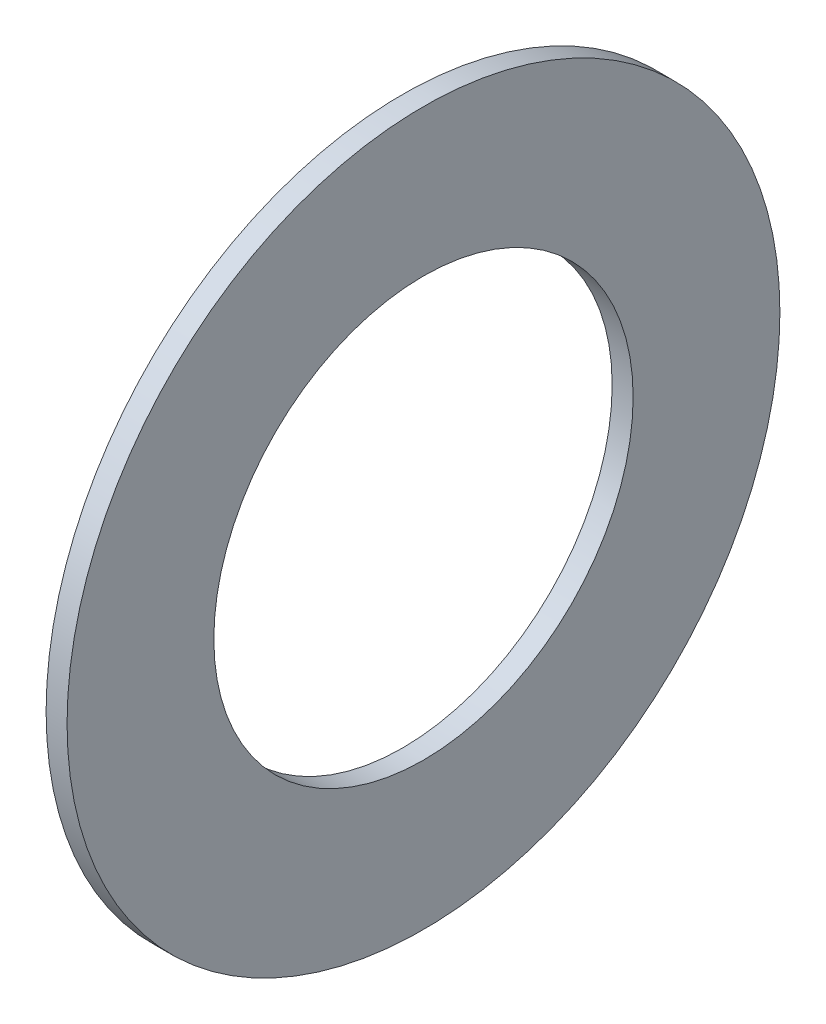
ISO-10303-21;
HEADER;
FILE_DESCRIPTION(('STEP AP214'),'2;1');
FILE_NAME('part.step','',(''),(''),'','','');
FILE_SCHEMA(('AUTOMOTIVE_DESIGN { 1 0 10303 214 1 1 1 1 }'));
ENDSEC;
DATA;
#1=APPLICATION_CONTEXT('core data for automotive mechanical design processes');
#2=APPLICATION_PROTOCOL_DEFINITION('international standard','automotive_design',2000,#1);
#3=PRODUCT_CONTEXT('',#1,'mechanical');
#4=PRODUCT('Part','Part','',(#3));
#5=PRODUCT_RELATED_PRODUCT_CATEGORY('part','',(#4));
#6=PRODUCT_DEFINITION_FORMATION('','',#4);
#7=PRODUCT_DEFINITION_CONTEXT('part definition',#1,'design');
#8=PRODUCT_DEFINITION('design','',#6,#7);
#9=PRODUCT_DEFINITION_SHAPE('','',#8);
#10=(LENGTH_UNIT() NAMED_UNIT(*) SI_UNIT(.MILLI.,.METRE.));
#11=(NAMED_UNIT(*) PLANE_ANGLE_UNIT() SI_UNIT($,.RADIAN.));
#12=(NAMED_UNIT(*) SI_UNIT($,.STERADIAN.) SOLID_ANGLE_UNIT());
#13=UNCERTAINTY_MEASURE_WITH_UNIT(LENGTH_MEASURE(1.E-05),#10,'distance_accuracy_value','');
#14=(GEOMETRIC_REPRESENTATION_CONTEXT(3) GLOBAL_UNCERTAINTY_ASSIGNED_CONTEXT((#13)) GLOBAL_UNIT_ASSIGNED_CONTEXT((#10,
#11,#12)) REPRESENTATION_CONTEXT('',''));
#15=CARTESIAN_POINT('',(0.,0.,0.));
#16=DIRECTION('',(0.,0.,1.));
#17=DIRECTION('',(1.,0.,0.));
#18=AXIS2_PLACEMENT_3D('',#15,#16,#17);
#19=CARTESIAN_POINT('',(-2.,17.,0.));
#20=DIRECTION('',(1.,0.,0.));
#21=DIRECTION('',(0.,0.,-1.));
#22=AXIS2_PLACEMENT_3D('',#19,#20,#21);
#23=PLANE('',#22);
#24=CARTESIAN_POINT('',(-2.,0.,0.));
#25=DIRECTION('',(-1.,0.,0.));
#26=DIRECTION('',(0.,0.,1.));
#27=AXIS2_PLACEMENT_3D('',#24,#25,#26);
#28=CIRCLE('',#27,10.);
#29=CARTESIAN_POINT('',(-2.,0.,10.));
#30=VERTEX_POINT('',#29);
#31=EDGE_CURVE('E10',#30,#30,#28,.T.);
#32=ORIENTED_EDGE('',*,*,#31,.F.);
#33=EDGE_LOOP('',(#32));
#34=FACE_BOUND('',#33,.T.);
#35=CARTESIAN_POINT('',(-2.,0.,0.));
#36=DIRECTION('',(-1.,0.,0.));
#37=DIRECTION('',(0.,0.,1.));
#38=AXIS2_PLACEMENT_3D('',#35,#36,#37);
#39=CIRCLE('',#38,17.);
#40=CARTESIAN_POINT('',(-2.,0.,17.));
#41=VERTEX_POINT('',#40);
#42=EDGE_CURVE('E43',#41,#41,#39,.T.);
#43=ORIENTED_EDGE('',*,*,#42,.T.);
#44=EDGE_LOOP('',(#43));
#45=FACE_BOUND('',#44,.T.);
#46=ADVANCED_FACE('F29',(#34,#45),#23,.F.);
#47=CARTESIAN_POINT('',(50.,0.,0.));
#48=DIRECTION('',(-1.,0.,0.));
#49=DIRECTION('',(0.,0.,1.));
#50=AXIS2_PLACEMENT_3D('',#47,#48,#49);
#51=CYLINDRICAL_SURFACE('',#50,10.);
#52=CARTESIAN_POINT('',(-1.,0.,0.));
#53=DIRECTION('',(-1.,0.,0.));
#54=DIRECTION('',(0.,0.,1.));
#55=AXIS2_PLACEMENT_3D('',#52,#53,#54);
#56=CIRCLE('',#55,10.);
#57=CARTESIAN_POINT('',(-1.,0.,10.));
#58=VERTEX_POINT('',#57);
#59=EDGE_CURVE('E35',#58,#58,#56,.T.);
#60=ORIENTED_EDGE('',*,*,#59,.F.);
#61=EDGE_LOOP('',(#60));
#62=FACE_BOUND('',#61,.T.);
#63=ORIENTED_EDGE('',*,*,#31,.T.);
#64=EDGE_LOOP('',(#63));
#65=FACE_BOUND('',#64,.T.);
#66=ADVANCED_FACE('F58',(#62,#65),#51,.F.);
#67=CARTESIAN_POINT('',(-1.,10.,0.));
#68=DIRECTION('',(-1.,0.,0.));
#69=DIRECTION('',(0.,0.,1.));
#70=AXIS2_PLACEMENT_3D('',#67,#68,#69);
#71=PLANE('',#70);
#72=CARTESIAN_POINT('',(-1.,0.,0.));
#73=DIRECTION('',(-1.,0.,0.));
#74=DIRECTION('',(0.,0.,1.));
#75=AXIS2_PLACEMENT_3D('',#72,#73,#74);
#76=CIRCLE('',#75,17.);
#77=CARTESIAN_POINT('',(-1.,0.,17.));
#78=VERTEX_POINT('',#77);
#79=EDGE_CURVE('E39',#78,#78,#76,.T.);
#80=ORIENTED_EDGE('',*,*,#79,.F.);
#81=EDGE_LOOP('',(#80));
#82=FACE_BOUND('',#81,.T.);
#83=ORIENTED_EDGE('',*,*,#59,.T.);
#84=EDGE_LOOP('',(#83));
#85=FACE_BOUND('',#84,.T.);
#86=ADVANCED_FACE('F53',(#82,#85),#71,.F.);
#87=CARTESIAN_POINT('',(50.,0.,0.));
#88=DIRECTION('',(-1.,0.,0.));
#89=DIRECTION('',(0.,0.,1.));
#90=AXIS2_PLACEMENT_3D('',#87,#88,#89);
#91=CYLINDRICAL_SURFACE('',#90,17.);
#92=ORIENTED_EDGE('',*,*,#42,.F.);
#93=EDGE_LOOP('',(#92));
#94=FACE_BOUND('',#93,.T.);
#95=ORIENTED_EDGE('',*,*,#79,.T.);
#96=EDGE_LOOP('',(#95));
#97=FACE_BOUND('',#96,.T.);
#98=ADVANCED_FACE('F50',(#94,#97),#91,.T.);
#99=CLOSED_SHELL('',(#46,#66,#86,#98));
#100=MANIFOLD_SOLID_BREP('B2',#99);
#101=ADVANCED_BREP_SHAPE_REPRESENTATION('',(#18,#100),#14);
#102=SHAPE_DEFINITION_REPRESENTATION(#9,#101);
ENDSEC;
END-ISO-10303-21;
